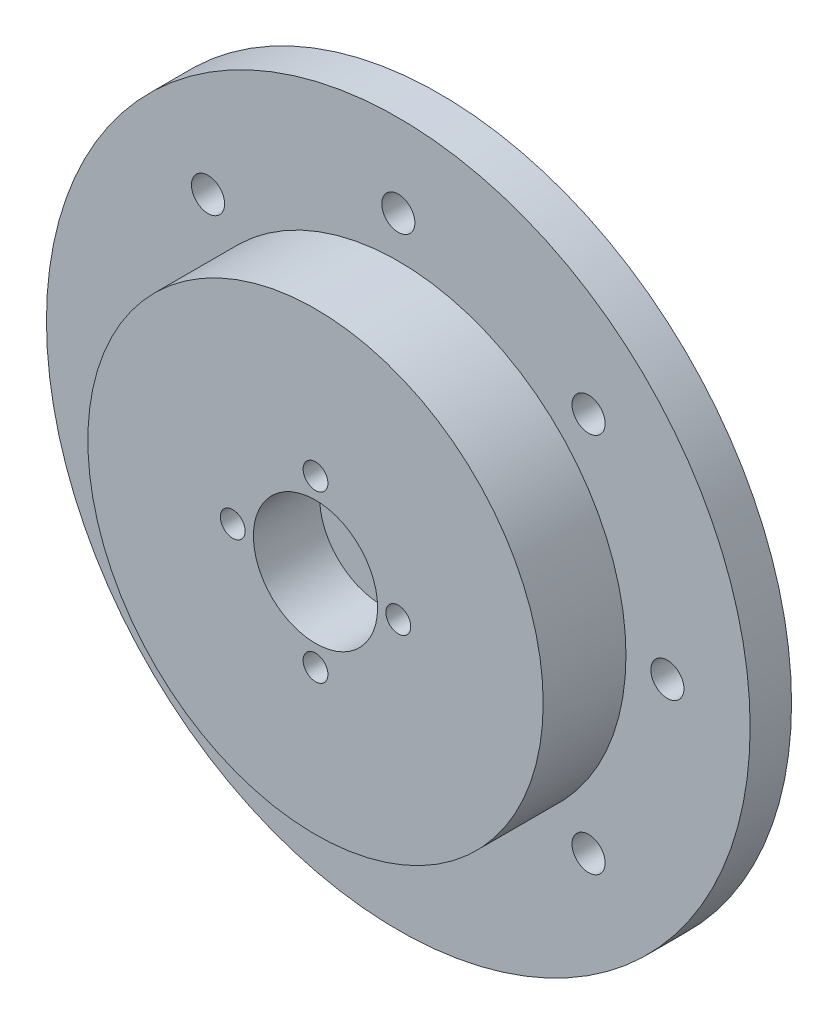
ISO-10303-21;
HEADER;
FILE_DESCRIPTION(('STEP AP214'),'2;1');
FILE_NAME('part.step','',(''),(''),'','','');
FILE_SCHEMA(('AUTOMOTIVE_DESIGN { 1 0 10303 214 1 1 1 1 }'));
ENDSEC;
DATA;
#1=APPLICATION_CONTEXT('core data for automotive mechanical design processes');
#2=APPLICATION_PROTOCOL_DEFINITION('international standard','automotive_design',2000,#1);
#3=PRODUCT_CONTEXT('',#1,'mechanical');
#4=PRODUCT('Part','Part','',(#3));
#5=PRODUCT_RELATED_PRODUCT_CATEGORY('part','',(#4));
#6=PRODUCT_DEFINITION_FORMATION('','',#4);
#7=PRODUCT_DEFINITION_CONTEXT('part definition',#1,'design');
#8=PRODUCT_DEFINITION('design','',#6,#7);
#9=PRODUCT_DEFINITION_SHAPE('','',#8);
#10=(LENGTH_UNIT() NAMED_UNIT(*) SI_UNIT(.MILLI.,.METRE.));
#11=(NAMED_UNIT(*) PLANE_ANGLE_UNIT() SI_UNIT($,.RADIAN.));
#12=(NAMED_UNIT(*) SI_UNIT($,.STERADIAN.) SOLID_ANGLE_UNIT());
#13=UNCERTAINTY_MEASURE_WITH_UNIT(LENGTH_MEASURE(1.E-05),#10,'distance_accuracy_value','');
#14=(GEOMETRIC_REPRESENTATION_CONTEXT(3) GLOBAL_UNCERTAINTY_ASSIGNED_CONTEXT((#13)) GLOBAL_UNIT_ASSIGNED_CONTEXT((#10,
#11,#12)) REPRESENTATION_CONTEXT('',''));
#15=CARTESIAN_POINT('',(0.,0.,0.));
#16=DIRECTION('',(0.,0.,1.));
#17=DIRECTION('',(1.,0.,0.));
#18=AXIS2_PLACEMENT_3D('',#15,#16,#17);
#19=CARTESIAN_POINT('',(0.,0.,5.));
#20=DIRECTION('',(0.,0.,-1.));
#21=DIRECTION('',(-1.,0.,0.));
#22=AXIS2_PLACEMENT_3D('',#19,#20,#21);
#23=CYLINDRICAL_SURFACE('',#22,42.5);
#24=CARTESIAN_POINT('',(0.,0.,5.));
#25=DIRECTION('',(0.,0.,1.));
#26=DIRECTION('',(1.,0.,0.));
#27=AXIS2_PLACEMENT_3D('',#24,#25,#26);
#28=CIRCLE('',#27,42.5);
#29=CARTESIAN_POINT('',(42.5,0.,5.));
#30=VERTEX_POINT('',#29);
#31=EDGE_CURVE('E45',#30,#30,#28,.T.);
#32=ORIENTED_EDGE('',*,*,#31,.F.);
#33=EDGE_LOOP('',(#32));
#34=FACE_BOUND('',#33,.T.);
#35=CARTESIAN_POINT('',(0.,0.,0.));
#36=DIRECTION('',(0.,0.,1.));
#37=DIRECTION('',(1.,0.,0.));
#38=AXIS2_PLACEMENT_3D('',#35,#36,#37);
#39=CIRCLE('',#38,42.5);
#40=CARTESIAN_POINT('',(42.5,0.,0.));
#41=VERTEX_POINT('',#40);
#42=EDGE_CURVE('E41',#41,#41,#39,.T.);
#43=ORIENTED_EDGE('',*,*,#42,.T.);
#44=EDGE_LOOP('',(#43));
#45=FACE_BOUND('',#44,.T.);
#46=ADVANCED_FACE('F38',(#34,#45),#23,.T.);
#47=CARTESIAN_POINT('',(0.,0.,5.));
#48=DIRECTION('',(0.,0.,1.));
#49=DIRECTION('',(1.,0.,0.));
#50=AXIS2_PLACEMENT_3D('',#47,#48,#49);
#51=PLANE('',#50);
#52=CARTESIAN_POINT('',(0.,32.5,5.));
#53=DIRECTION('',(0.,0.,1.));
#54=DIRECTION('',(1.,0.,0.));
#55=AXIS2_PLACEMENT_3D('',#52,#53,#54);
#56=CIRCLE('',#55,2.);
#57=CARTESIAN_POINT('',(2.,32.5,5.));
#58=VERTEX_POINT('',#57);
#59=EDGE_CURVE('E127',#58,#58,#56,.T.);
#60=ORIENTED_EDGE('',*,*,#59,.F.);
#61=EDGE_LOOP('',(#60));
#62=FACE_BOUND('',#61,.T.);
#63=CARTESIAN_POINT('',(22.9809703885632,22.9809703885638,5.));
#64=DIRECTION('',(0.,0.,1.));
#65=DIRECTION('',(1.,0.,0.));
#66=AXIS2_PLACEMENT_3D('',#63,#64,#65);
#67=CIRCLE('',#66,2.00000000000016);
#68=CARTESIAN_POINT('',(24.9809703885634,22.9809703885638,5.));
#69=VERTEX_POINT('',#68);
#70=EDGE_CURVE('E124',#69,#69,#67,.T.);
#71=ORIENTED_EDGE('',*,*,#70,.F.);
#72=EDGE_LOOP('',(#71));
#73=FACE_BOUND('',#72,.T.);
#74=CARTESIAN_POINT('',(32.5000000000014,1.37958818158635E-12,5.));
#75=DIRECTION('',(0.,0.,1.));
#76=DIRECTION('',(1.,0.,0.));
#77=AXIS2_PLACEMENT_3D('',#74,#75,#76);
#78=CIRCLE('',#77,2.00000000000103);
#79=CARTESIAN_POINT('',(34.5000000000024,1.37958818158635E-12,5.));
#80=VERTEX_POINT('',#79);
#81=EDGE_CURVE('E118',#80,#80,#78,.T.);
#82=ORIENTED_EDGE('',*,*,#81,.F.);
#83=EDGE_LOOP('',(#82));
#84=FACE_BOUND('',#83,.T.);
#85=CARTESIAN_POINT('',(22.9809703885651,-22.9809703885618,5.));
#86=DIRECTION('',(0.,0.,1.));
#87=DIRECTION('',(1.,0.,0.));
#88=AXIS2_PLACEMENT_3D('',#85,#86,#87);
#89=CIRCLE('',#88,2.00000000000213);
#90=CARTESIAN_POINT('',(24.9809703885673,-22.9809703885618,5.));
#91=VERTEX_POINT('',#90);
#92=EDGE_CURVE('E112',#91,#91,#89,.T.);
#93=ORIENTED_EDGE('',*,*,#92,.F.);
#94=EDGE_LOOP('',(#93));
#95=FACE_BOUND('',#94,.T.);
#96=CARTESIAN_POINT('',(2.7591763631727E-12,-32.5,5.));
#97=DIRECTION('',(0.,0.,1.));
#98=DIRECTION('',(1.,0.,0.));
#99=AXIS2_PLACEMENT_3D('',#96,#97,#98);
#100=CIRCLE('',#99,2.00000000000286);
#101=CARTESIAN_POINT('',(2.00000000000562,-32.5,5.));
#102=VERTEX_POINT('',#101);
#103=EDGE_CURVE('E106',#102,#102,#100,.T.);
#104=ORIENTED_EDGE('',*,*,#103,.F.);
#105=EDGE_LOOP('',(#104));
#106=FACE_BOUND('',#105,.T.);
#107=CARTESIAN_POINT('',(-22.9809703885604,-22.9809703885638,5.));
#108=DIRECTION('',(0.,0.,1.));
#109=DIRECTION('',(1.,0.,0.));
#110=AXIS2_PLACEMENT_3D('',#107,#108,#109);
#111=CIRCLE('',#110,2.00000000000281);
#112=CARTESIAN_POINT('',(-20.9809703885576,-22.9809703885638,5.));
#113=VERTEX_POINT('',#112);
#114=EDGE_CURVE('E100',#113,#113,#111,.T.);
#115=ORIENTED_EDGE('',*,*,#114,.F.);
#116=EDGE_LOOP('',(#115));
#117=FACE_BOUND('',#116,.T.);
#118=CARTESIAN_POINT('',(-32.4999999999986,-1.38356828368358E-12,5.));
#119=DIRECTION('',(0.,0.,1.));
#120=DIRECTION('',(1.,0.,0.));
#121=AXIS2_PLACEMENT_3D('',#118,#119,#120);
#122=CIRCLE('',#121,2.00000000000205);
#123=CARTESIAN_POINT('',(-30.4999999999966,-1.38356828368358E-12,5.));
#124=VERTEX_POINT('',#123);
#125=EDGE_CURVE('E94',#124,#124,#122,.T.);
#126=ORIENTED_EDGE('',*,*,#125,.F.);
#127=EDGE_LOOP('',(#126));
#128=FACE_BOUND('',#127,.T.);
#129=CARTESIAN_POINT('',(-22.9809703885624,22.9809703885618,5.));
#130=DIRECTION('',(0.,0.,1.));
#131=DIRECTION('',(1.,0.,0.));
#132=AXIS2_PLACEMENT_3D('',#129,#130,#131);
#133=CIRCLE('',#132,2.00000000000106);
#134=CARTESIAN_POINT('',(-20.9809703885613,22.9809703885618,5.));
#135=VERTEX_POINT('',#134);
#136=EDGE_CURVE('E88',#135,#135,#133,.T.);
#137=ORIENTED_EDGE('',*,*,#136,.F.);
#138=EDGE_LOOP('',(#137));
#139=FACE_BOUND('',#138,.T.);
#140=CARTESIAN_POINT('',(0.,0.,5.));
#141=DIRECTION('',(0.,0.,1.));
#142=DIRECTION('',(1.,0.,0.));
#143=AXIS2_PLACEMENT_3D('',#140,#141,#142);
#144=CIRCLE('',#143,27.5);
#145=CARTESIAN_POINT('',(27.5,0.,5.));
#146=VERTEX_POINT('',#145);
#147=EDGE_CURVE('E10',#146,#146,#144,.T.);
#148=ORIENTED_EDGE('',*,*,#147,.F.);
#149=EDGE_LOOP('',(#148));
#150=FACE_BOUND('',#149,.T.);
#151=ORIENTED_EDGE('',*,*,#31,.T.);
#152=EDGE_LOOP('',(#151));
#153=FACE_BOUND('',#152,.T.);
#154=ADVANCED_FACE('F143',(#62,#73,#84,#95,#106,#117,#128,#139,#150,#153),#51,.T.);
#155=CARTESIAN_POINT('',(0.,0.,0.));
#156=DIRECTION('',(0.,0.,1.));
#157=DIRECTION('',(1.,0.,0.));
#158=AXIS2_PLACEMENT_3D('',#155,#156,#157);
#159=PLANE('',#158);
#160=CARTESIAN_POINT('',(0.,32.5,0.));
#161=DIRECTION('',(0.,0.,1.));
#162=DIRECTION('',(1.,0.,0.));
#163=AXIS2_PLACEMENT_3D('',#160,#161,#162);
#164=CIRCLE('',#163,2.);
#165=CARTESIAN_POINT('',(2.,32.5,0.));
#166=VERTEX_POINT('',#165);
#167=EDGE_CURVE('E65',#166,#166,#164,.T.);
#168=ORIENTED_EDGE('',*,*,#167,.T.);
#169=EDGE_LOOP('',(#168));
#170=FACE_BOUND('',#169,.T.);
#171=CARTESIAN_POINT('',(22.9809703885632,22.9809703885638,0.));
#172=DIRECTION('',(0.,0.,1.));
#173=DIRECTION('',(1.,0.,0.));
#174=AXIS2_PLACEMENT_3D('',#171,#172,#173);
#175=CIRCLE('',#174,2.00000000000016);
#176=CARTESIAN_POINT('',(24.9809703885634,22.9809703885638,0.));
#177=VERTEX_POINT('',#176);
#178=EDGE_CURVE('E121',#177,#177,#175,.T.);
#179=ORIENTED_EDGE('',*,*,#178,.T.);
#180=EDGE_LOOP('',(#179));
#181=FACE_BOUND('',#180,.T.);
#182=CARTESIAN_POINT('',(32.5000000000014,1.37958818158635E-12,0.));
#183=DIRECTION('',(0.,0.,1.));
#184=DIRECTION('',(1.,0.,0.));
#185=AXIS2_PLACEMENT_3D('',#182,#183,#184);
#186=CIRCLE('',#185,2.00000000000103);
#187=CARTESIAN_POINT('',(34.5000000000024,1.37958818158635E-12,0.));
#188=VERTEX_POINT('',#187);
#189=EDGE_CURVE('E115',#188,#188,#186,.T.);
#190=ORIENTED_EDGE('',*,*,#189,.T.);
#191=EDGE_LOOP('',(#190));
#192=FACE_BOUND('',#191,.T.);
#193=CARTESIAN_POINT('',(22.9809703885651,-22.9809703885618,0.));
#194=DIRECTION('',(0.,0.,1.));
#195=DIRECTION('',(1.,0.,0.));
#196=AXIS2_PLACEMENT_3D('',#193,#194,#195);
#197=CIRCLE('',#196,2.00000000000213);
#198=CARTESIAN_POINT('',(24.9809703885673,-22.9809703885618,0.));
#199=VERTEX_POINT('',#198);
#200=EDGE_CURVE('E109',#199,#199,#197,.T.);
#201=ORIENTED_EDGE('',*,*,#200,.T.);
#202=EDGE_LOOP('',(#201));
#203=FACE_BOUND('',#202,.T.);
#204=CARTESIAN_POINT('',(2.7591763631727E-12,-32.5,0.));
#205=DIRECTION('',(0.,0.,1.));
#206=DIRECTION('',(1.,0.,0.));
#207=AXIS2_PLACEMENT_3D('',#204,#205,#206);
#208=CIRCLE('',#207,2.00000000000286);
#209=CARTESIAN_POINT('',(2.00000000000562,-32.5,0.));
#210=VERTEX_POINT('',#209);
#211=EDGE_CURVE('E103',#210,#210,#208,.T.);
#212=ORIENTED_EDGE('',*,*,#211,.T.);
#213=EDGE_LOOP('',(#212));
#214=FACE_BOUND('',#213,.T.);
#215=CARTESIAN_POINT('',(-22.9809703885604,-22.9809703885638,0.));
#216=DIRECTION('',(0.,0.,1.));
#217=DIRECTION('',(1.,0.,0.));
#218=AXIS2_PLACEMENT_3D('',#215,#216,#217);
#219=CIRCLE('',#218,2.00000000000281);
#220=CARTESIAN_POINT('',(-20.9809703885576,-22.9809703885638,0.));
#221=VERTEX_POINT('',#220);
#222=EDGE_CURVE('E97',#221,#221,#219,.T.);
#223=ORIENTED_EDGE('',*,*,#222,.T.);
#224=EDGE_LOOP('',(#223));
#225=FACE_BOUND('',#224,.T.);
#226=CARTESIAN_POINT('',(-32.4999999999986,-1.38356828368358E-12,0.));
#227=DIRECTION('',(0.,0.,1.));
#228=DIRECTION('',(1.,0.,0.));
#229=AXIS2_PLACEMENT_3D('',#226,#227,#228);
#230=CIRCLE('',#229,2.00000000000205);
#231=CARTESIAN_POINT('',(-30.4999999999966,-1.38356828368358E-12,0.));
#232=VERTEX_POINT('',#231);
#233=EDGE_CURVE('E91',#232,#232,#230,.T.);
#234=ORIENTED_EDGE('',*,*,#233,.T.);
#235=EDGE_LOOP('',(#234));
#236=FACE_BOUND('',#235,.T.);
#237=CARTESIAN_POINT('',(-22.9809703885624,22.9809703885618,0.));
#238=DIRECTION('',(0.,0.,1.));
#239=DIRECTION('',(1.,0.,0.));
#240=AXIS2_PLACEMENT_3D('',#237,#238,#239);
#241=CIRCLE('',#240,2.00000000000106);
#242=CARTESIAN_POINT('',(-20.9809703885613,22.9809703885618,0.));
#243=VERTEX_POINT('',#242);
#244=EDGE_CURVE('E85',#243,#243,#241,.T.);
#245=ORIENTED_EDGE('',*,*,#244,.T.);
#246=EDGE_LOOP('',(#245));
#247=FACE_BOUND('',#246,.T.);
#248=CARTESIAN_POINT('',(0.,10.,0.));
#249=DIRECTION('',(0.,0.,1.));
#250=DIRECTION('',(1.,0.,0.));
#251=AXIS2_PLACEMENT_3D('',#248,#249,#250);
#252=CIRCLE('',#251,1.5);
#253=CARTESIAN_POINT('',(1.5,10.,0.));
#254=VERTEX_POINT('',#253);
#255=EDGE_CURVE('E58',#254,#254,#252,.T.);
#256=ORIENTED_EDGE('',*,*,#255,.T.);
#257=EDGE_LOOP('',(#256));
#258=FACE_BOUND('',#257,.T.);
#259=CARTESIAN_POINT('',(10.0000000000003,2.82380124105319E-13,0.));
#260=DIRECTION('',(0.,0.,1.));
#261=DIRECTION('',(1.,0.,0.));
#262=AXIS2_PLACEMENT_3D('',#259,#260,#261);
#263=CIRCLE('',#262,1.50000000000022);
#264=CARTESIAN_POINT('',(11.5000000000005,2.82380124105319E-13,0.));
#265=VERTEX_POINT('',#264);
#266=EDGE_CURVE('E74',#265,#265,#263,.T.);
#267=ORIENTED_EDGE('',*,*,#266,.T.);
#268=EDGE_LOOP('',(#267));
#269=FACE_BOUND('',#268,.T.);
#270=CARTESIAN_POINT('',(5.64760248210638E-13,-10.,0.));
#271=DIRECTION('',(0.,0.,1.));
#272=DIRECTION('',(1.,0.,0.));
#273=AXIS2_PLACEMENT_3D('',#270,#271,#272);
#274=CIRCLE('',#273,1.50000000000061);
#275=CARTESIAN_POINT('',(1.50000000000117,-10.,0.));
#276=VERTEX_POINT('',#275);
#277=EDGE_CURVE('E68',#276,#276,#274,.T.);
#278=ORIENTED_EDGE('',*,*,#277,.T.);
#279=EDGE_LOOP('',(#278));
#280=FACE_BOUND('',#279,.T.);
#281=CARTESIAN_POINT('',(-9.99999999999972,-2.83604770904466E-13,0.));
#282=DIRECTION('',(0.,0.,1.));
#283=DIRECTION('',(1.,0.,0.));
#284=AXIS2_PLACEMENT_3D('',#281,#282,#283);
#285=CIRCLE('',#284,1.50000000000045);
#286=CARTESIAN_POINT('',(-8.49999999999927,-2.83604770904466E-13,0.));
#287=VERTEX_POINT('',#286);
#288=EDGE_CURVE('E61',#287,#287,#285,.T.);
#289=ORIENTED_EDGE('',*,*,#288,.T.);
#290=EDGE_LOOP('',(#289));
#291=FACE_BOUND('',#290,.T.);
#292=ORIENTED_EDGE('',*,*,#42,.F.);
#293=EDGE_LOOP('',(#292));
#294=FACE_BOUND('',#293,.T.);
#295=ADVANCED_FACE('F133',(#170,#181,#192,#203,#214,#225,#236,#247,#258,#269,#280,#291,#294),
#159,.F.);
#296=CARTESIAN_POINT('',(0.,0.,15.));
#297=DIRECTION('',(0.,0.,-1.));
#298=DIRECTION('',(-1.,0.,0.));
#299=AXIS2_PLACEMENT_3D('',#296,#297,#298);
#300=CYLINDRICAL_SURFACE('',#299,27.5);
#301=CARTESIAN_POINT('',(0.,0.,15.));
#302=DIRECTION('',(0.,0.,1.));
#303=DIRECTION('',(1.,0.,0.));
#304=AXIS2_PLACEMENT_3D('',#301,#302,#303);
#305=CIRCLE('',#304,27.5);
#306=CARTESIAN_POINT('',(27.5,0.,15.));
#307=VERTEX_POINT('',#306);
#308=EDGE_CURVE('E51',#307,#307,#305,.T.);
#309=ORIENTED_EDGE('',*,*,#308,.F.);
#310=EDGE_LOOP('',(#309));
#311=FACE_BOUND('',#310,.T.);
#312=ORIENTED_EDGE('',*,*,#147,.T.);
#313=EDGE_LOOP('',(#312));
#314=FACE_BOUND('',#313,.T.);
#315=ADVANCED_FACE('F170',(#311,#314),#300,.T.);
#316=CARTESIAN_POINT('',(0.,0.,15.));
#317=DIRECTION('',(0.,0.,1.));
#318=DIRECTION('',(1.,0.,0.));
#319=AXIS2_PLACEMENT_3D('',#316,#317,#318);
#320=PLANE('',#319);
#321=CARTESIAN_POINT('',(0.,10.,15.));
#322=DIRECTION('',(0.,0.,1.));
#323=DIRECTION('',(1.,0.,0.));
#324=AXIS2_PLACEMENT_3D('',#321,#322,#323);
#325=CIRCLE('',#324,1.5);
#326=CARTESIAN_POINT('',(1.5,10.,15.));
#327=VERTEX_POINT('',#326);
#328=EDGE_CURVE('E80',#327,#327,#325,.T.);
#329=ORIENTED_EDGE('',*,*,#328,.F.);
#330=EDGE_LOOP('',(#329));
#331=FACE_BOUND('',#330,.T.);
#332=CARTESIAN_POINT('',(10.0000000000003,2.82380124105319E-13,15.));
#333=DIRECTION('',(0.,0.,1.));
#334=DIRECTION('',(1.,0.,0.));
#335=AXIS2_PLACEMENT_3D('',#332,#333,#334);
#336=CIRCLE('',#335,1.50000000000022);
#337=CARTESIAN_POINT('',(11.5000000000005,2.82380124105319E-13,15.));
#338=VERTEX_POINT('',#337);
#339=EDGE_CURVE('E77',#338,#338,#336,.T.);
#340=ORIENTED_EDGE('',*,*,#339,.F.);
#341=EDGE_LOOP('',(#340));
#342=FACE_BOUND('',#341,.T.);
#343=CARTESIAN_POINT('',(5.64760248210638E-13,-10.,15.));
#344=DIRECTION('',(0.,0.,1.));
#345=DIRECTION('',(1.,0.,0.));
#346=AXIS2_PLACEMENT_3D('',#343,#344,#345);
#347=CIRCLE('',#346,1.50000000000061);
#348=CARTESIAN_POINT('',(1.50000000000117,-10.,15.));
#349=VERTEX_POINT('',#348);
#350=EDGE_CURVE('E71',#349,#349,#347,.T.);
#351=ORIENTED_EDGE('',*,*,#350,.F.);
#352=EDGE_LOOP('',(#351));
#353=FACE_BOUND('',#352,.T.);
#354=CARTESIAN_POINT('',(-9.99999999999972,-2.83604770904466E-13,15.));
#355=DIRECTION('',(0.,0.,1.));
#356=DIRECTION('',(1.,0.,0.));
#357=AXIS2_PLACEMENT_3D('',#354,#355,#356);
#358=CIRCLE('',#357,1.50000000000045);
#359=CARTESIAN_POINT('',(-8.49999999999927,-2.83604770904466E-13,15.));
#360=VERTEX_POINT('',#359);
#361=EDGE_CURVE('E64',#360,#360,#358,.T.);
#362=ORIENTED_EDGE('',*,*,#361,.F.);
#363=EDGE_LOOP('',(#362));
#364=FACE_BOUND('',#363,.T.);
#365=CARTESIAN_POINT('',(0.,0.,15.));
#366=DIRECTION('',(0.,0.,1.));
#367=DIRECTION('',(1.,0.,0.));
#368=AXIS2_PLACEMENT_3D('',#365,#366,#367);
#369=CIRCLE('',#368,7.5);
#370=CARTESIAN_POINT('',(7.5,0.,15.));
#371=VERTEX_POINT('',#370);
#372=EDGE_CURVE('E55',#371,#371,#369,.T.);
#373=ORIENTED_EDGE('',*,*,#372,.F.);
#374=EDGE_LOOP('',(#373));
#375=FACE_BOUND('',#374,.T.);
#376=ORIENTED_EDGE('',*,*,#308,.T.);
#377=EDGE_LOOP('',(#376));
#378=FACE_BOUND('',#377,.T.);
#379=ADVANCED_FACE('F174',(#331,#342,#353,#364,#375,#378),#320,.T.);
#380=CARTESIAN_POINT('',(0.,0.,7.));
#381=DIRECTION('',(0.,0.,1.));
#382=DIRECTION('',(1.,0.,0.));
#383=AXIS2_PLACEMENT_3D('',#380,#381,#382);
#384=CYLINDRICAL_SURFACE('',#383,7.5);
#385=CARTESIAN_POINT('',(0.,0.,7.));
#386=DIRECTION('',(0.,0.,1.));
#387=DIRECTION('',(1.,0.,0.));
#388=AXIS2_PLACEMENT_3D('',#385,#386,#387);
#389=CIRCLE('',#388,7.5);
#390=CARTESIAN_POINT('',(7.5,0.,7.));
#391=VERTEX_POINT('',#390);
#392=EDGE_CURVE('E54',#391,#391,#389,.T.);
#393=ORIENTED_EDGE('',*,*,#392,.F.);
#394=EDGE_LOOP('',(#393));
#395=FACE_BOUND('',#394,.T.);
#396=ORIENTED_EDGE('',*,*,#372,.T.);
#397=EDGE_LOOP('',(#396));
#398=FACE_BOUND('',#397,.T.);
#399=ADVANCED_FACE('F180',(#395,#398),#384,.F.);
#400=CARTESIAN_POINT('',(0.,0.,7.));
#401=DIRECTION('',(0.,0.,1.));
#402=DIRECTION('',(1.,0.,0.));
#403=AXIS2_PLACEMENT_3D('',#400,#401,#402);
#404=PLANE('',#403);
#405=ORIENTED_EDGE('',*,*,#392,.T.);
#406=EDGE_LOOP('',(#405));
#407=FACE_BOUND('',#406,.T.);
#408=ADVANCED_FACE('F184',(#407),#404,.T.);
#409=CARTESIAN_POINT('',(-9.99999999999972,-2.83604770904466E-13,0.));
#410=DIRECTION('',(0.,0.,1.));
#411=DIRECTION('',(1.,0.,0.));
#412=AXIS2_PLACEMENT_3D('',#409,#410,#411);
#413=CYLINDRICAL_SURFACE('',#412,1.50000000000045);
#414=ORIENTED_EDGE('',*,*,#288,.F.);
#415=EDGE_LOOP('',(#414));
#416=FACE_BOUND('',#415,.T.);
#417=ORIENTED_EDGE('',*,*,#361,.T.);
#418=EDGE_LOOP('',(#417));
#419=FACE_BOUND('',#418,.T.);
#420=ADVANCED_FACE('F188',(#416,#419),#413,.F.);
#421=CARTESIAN_POINT('',(5.64760248210638E-13,-10.,0.));
#422=DIRECTION('',(0.,0.,1.));
#423=DIRECTION('',(1.,0.,0.));
#424=AXIS2_PLACEMENT_3D('',#421,#422,#423);
#425=CYLINDRICAL_SURFACE('',#424,1.50000000000061);
#426=ORIENTED_EDGE('',*,*,#277,.F.);
#427=EDGE_LOOP('',(#426));
#428=FACE_BOUND('',#427,.T.);
#429=ORIENTED_EDGE('',*,*,#350,.T.);
#430=EDGE_LOOP('',(#429));
#431=FACE_BOUND('',#430,.T.);
#432=ADVANCED_FACE('F192',(#428,#431),#425,.F.);
#433=CARTESIAN_POINT('',(10.0000000000003,2.82380124105319E-13,0.));
#434=DIRECTION('',(0.,0.,1.));
#435=DIRECTION('',(1.,0.,0.));
#436=AXIS2_PLACEMENT_3D('',#433,#434,#435);
#437=CYLINDRICAL_SURFACE('',#436,1.50000000000022);
#438=ORIENTED_EDGE('',*,*,#266,.F.);
#439=EDGE_LOOP('',(#438));
#440=FACE_BOUND('',#439,.T.);
#441=ORIENTED_EDGE('',*,*,#339,.T.);
#442=EDGE_LOOP('',(#441));
#443=FACE_BOUND('',#442,.T.);
#444=ADVANCED_FACE('F196',(#440,#443),#437,.F.);
#445=CARTESIAN_POINT('',(0.,10.,0.));
#446=DIRECTION('',(0.,0.,1.));
#447=DIRECTION('',(1.,0.,0.));
#448=AXIS2_PLACEMENT_3D('',#445,#446,#447);
#449=CYLINDRICAL_SURFACE('',#448,1.5);
#450=ORIENTED_EDGE('',*,*,#255,.F.);
#451=EDGE_LOOP('',(#450));
#452=FACE_BOUND('',#451,.T.);
#453=ORIENTED_EDGE('',*,*,#328,.T.);
#454=EDGE_LOOP('',(#453));
#455=FACE_BOUND('',#454,.T.);
#456=ADVANCED_FACE('F200',(#452,#455),#449,.F.);
#457=CARTESIAN_POINT('',(-22.9809703885624,22.9809703885618,0.));
#458=DIRECTION('',(0.,0.,1.));
#459=DIRECTION('',(1.,0.,0.));
#460=AXIS2_PLACEMENT_3D('',#457,#458,#459);
#461=CYLINDRICAL_SURFACE('',#460,2.00000000000106);
#462=ORIENTED_EDGE('',*,*,#244,.F.);
#463=EDGE_LOOP('',(#462));
#464=FACE_BOUND('',#463,.T.);
#465=ORIENTED_EDGE('',*,*,#136,.T.);
#466=EDGE_LOOP('',(#465));
#467=FACE_BOUND('',#466,.T.);
#468=ADVANCED_FACE('F204',(#464,#467),#461,.F.);
#469=CARTESIAN_POINT('',(-32.4999999999986,-1.38356828368358E-12,0.));
#470=DIRECTION('',(0.,0.,1.));
#471=DIRECTION('',(1.,0.,0.));
#472=AXIS2_PLACEMENT_3D('',#469,#470,#471);
#473=CYLINDRICAL_SURFACE('',#472,2.00000000000205);
#474=ORIENTED_EDGE('',*,*,#233,.F.);
#475=EDGE_LOOP('',(#474));
#476=FACE_BOUND('',#475,.T.);
#477=ORIENTED_EDGE('',*,*,#125,.T.);
#478=EDGE_LOOP('',(#477));
#479=FACE_BOUND('',#478,.T.);
#480=ADVANCED_FACE('F208',(#476,#479),#473,.F.);
#481=CARTESIAN_POINT('',(-22.9809703885604,-22.9809703885638,0.));
#482=DIRECTION('',(0.,0.,1.));
#483=DIRECTION('',(1.,0.,0.));
#484=AXIS2_PLACEMENT_3D('',#481,#482,#483);
#485=CYLINDRICAL_SURFACE('',#484,2.00000000000281);
#486=ORIENTED_EDGE('',*,*,#222,.F.);
#487=EDGE_LOOP('',(#486));
#488=FACE_BOUND('',#487,.T.);
#489=ORIENTED_EDGE('',*,*,#114,.T.);
#490=EDGE_LOOP('',(#489));
#491=FACE_BOUND('',#490,.T.);
#492=ADVANCED_FACE('F212',(#488,#491),#485,.F.);
#493=CARTESIAN_POINT('',(2.7591763631727E-12,-32.5,0.));
#494=DIRECTION('',(0.,0.,1.));
#495=DIRECTION('',(1.,0.,0.));
#496=AXIS2_PLACEMENT_3D('',#493,#494,#495);
#497=CYLINDRICAL_SURFACE('',#496,2.00000000000286);
#498=ORIENTED_EDGE('',*,*,#211,.F.);
#499=EDGE_LOOP('',(#498));
#500=FACE_BOUND('',#499,.T.);
#501=ORIENTED_EDGE('',*,*,#103,.T.);
#502=EDGE_LOOP('',(#501));
#503=FACE_BOUND('',#502,.T.);
#504=ADVANCED_FACE('F216',(#500,#503),#497,.F.);
#505=CARTESIAN_POINT('',(22.9809703885651,-22.9809703885618,0.));
#506=DIRECTION('',(0.,0.,1.));
#507=DIRECTION('',(1.,0.,0.));
#508=AXIS2_PLACEMENT_3D('',#505,#506,#507);
#509=CYLINDRICAL_SURFACE('',#508,2.00000000000213);
#510=ORIENTED_EDGE('',*,*,#200,.F.);
#511=EDGE_LOOP('',(#510));
#512=FACE_BOUND('',#511,.T.);
#513=ORIENTED_EDGE('',*,*,#92,.T.);
#514=EDGE_LOOP('',(#513));
#515=FACE_BOUND('',#514,.T.);
#516=ADVANCED_FACE('F220',(#512,#515),#509,.F.);
#517=CARTESIAN_POINT('',(32.5000000000014,1.37958818158635E-12,0.));
#518=DIRECTION('',(0.,0.,1.));
#519=DIRECTION('',(1.,0.,0.));
#520=AXIS2_PLACEMENT_3D('',#517,#518,#519);
#521=CYLINDRICAL_SURFACE('',#520,2.00000000000103);
#522=ORIENTED_EDGE('',*,*,#189,.F.);
#523=EDGE_LOOP('',(#522));
#524=FACE_BOUND('',#523,.T.);
#525=ORIENTED_EDGE('',*,*,#81,.T.);
#526=EDGE_LOOP('',(#525));
#527=FACE_BOUND('',#526,.T.);
#528=ADVANCED_FACE('F224',(#524,#527),#521,.F.);
#529=CARTESIAN_POINT('',(22.9809703885632,22.9809703885638,0.));
#530=DIRECTION('',(0.,0.,1.));
#531=DIRECTION('',(1.,0.,0.));
#532=AXIS2_PLACEMENT_3D('',#529,#530,#531);
#533=CYLINDRICAL_SURFACE('',#532,2.00000000000016);
#534=ORIENTED_EDGE('',*,*,#178,.F.);
#535=EDGE_LOOP('',(#534));
#536=FACE_BOUND('',#535,.T.);
#537=ORIENTED_EDGE('',*,*,#70,.T.);
#538=EDGE_LOOP('',(#537));
#539=FACE_BOUND('',#538,.T.);
#540=ADVANCED_FACE('F139',(#536,#539),#533,.F.);
#541=CARTESIAN_POINT('',(0.,32.5,0.));
#542=DIRECTION('',(0.,0.,1.));
#543=DIRECTION('',(1.,0.,0.));
#544=AXIS2_PLACEMENT_3D('',#541,#542,#543);
#545=CYLINDRICAL_SURFACE('',#544,2.);
#546=ORIENTED_EDGE('',*,*,#167,.F.);
#547=EDGE_LOOP('',(#546));
#548=FACE_BOUND('',#547,.T.);
#549=ORIENTED_EDGE('',*,*,#59,.T.);
#550=EDGE_LOOP('',(#549));
#551=FACE_BOUND('',#550,.T.);
#552=ADVANCED_FACE('F136',(#548,#551),#545,.F.);
#553=CLOSED_SHELL('',(#46,#154,#295,#315,#379,#399,#408,#420,#432,#444,#456,#468,#480,#492,#504,
#516,#528,#540,#552));
#554=MANIFOLD_SOLID_BREP('B2',#553);
#555=ADVANCED_BREP_SHAPE_REPRESENTATION('',(#18,#554),#14);
#556=SHAPE_DEFINITION_REPRESENTATION(#9,#555);
ENDSEC;
END-ISO-10303-21;
